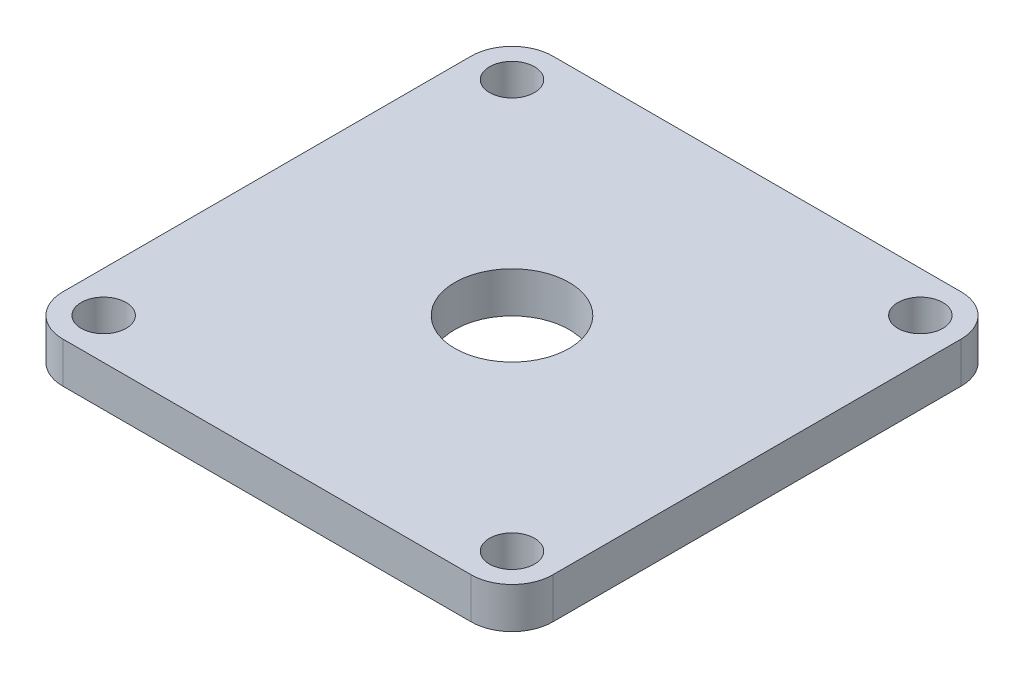
ISO-10303-21;
HEADER;
FILE_DESCRIPTION(('STEP AP214'),'2;1');
FILE_NAME('part.step','',(''),(''),'','','');
FILE_SCHEMA(('AUTOMOTIVE_DESIGN { 1 0 10303 214 1 1 1 1 }'));
ENDSEC;
DATA;
#1=APPLICATION_CONTEXT('core data for automotive mechanical design processes');
#2=APPLICATION_PROTOCOL_DEFINITION('international standard','automotive_design',2000,#1);
#3=PRODUCT_CONTEXT('',#1,'mechanical');
#4=PRODUCT('Part','Part','',(#3));
#5=PRODUCT_RELATED_PRODUCT_CATEGORY('part','',(#4));
#6=PRODUCT_DEFINITION_FORMATION('','',#4);
#7=PRODUCT_DEFINITION_CONTEXT('part definition',#1,'design');
#8=PRODUCT_DEFINITION('design','',#6,#7);
#9=PRODUCT_DEFINITION_SHAPE('','',#8);
#10=(LENGTH_UNIT() NAMED_UNIT(*) SI_UNIT(.MILLI.,.METRE.));
#11=(NAMED_UNIT(*) PLANE_ANGLE_UNIT() SI_UNIT($,.RADIAN.));
#12=(NAMED_UNIT(*) SI_UNIT($,.STERADIAN.) SOLID_ANGLE_UNIT());
#13=UNCERTAINTY_MEASURE_WITH_UNIT(LENGTH_MEASURE(1.E-05),#10,'distance_accuracy_value','');
#14=(GEOMETRIC_REPRESENTATION_CONTEXT(3) GLOBAL_UNCERTAINTY_ASSIGNED_CONTEXT((#13)) GLOBAL_UNIT_ASSIGNED_CONTEXT((#10,
#11,#12)) REPRESENTATION_CONTEXT('',''));
#15=CARTESIAN_POINT('',(0.,0.,0.));
#16=DIRECTION('',(0.,0.,1.));
#17=DIRECTION('',(1.,0.,0.));
#18=AXIS2_PLACEMENT_3D('',#15,#16,#17);
#19=CARTESIAN_POINT('',(-30.,5.,-30.));
#20=DIRECTION('',(1.,0.,0.));
#21=DIRECTION('',(0.,0.,-1.));
#22=AXIS2_PLACEMENT_3D('',#19,#20,#21);
#23=PLANE('',#22);
#24=DIRECTION('',(0.,0.,1.));
#25=VECTOR('',#24,1.);
#26=CARTESIAN_POINT('',(-30.,5.,-30.));
#27=LINE('',#26,#25);
#28=CARTESIAN_POINT('',(-30.,5.,-25.));
#29=VERTEX_POINT('',#28);
#30=CARTESIAN_POINT('',(-30.,5.,25.));
#31=VERTEX_POINT('',#30);
#32=EDGE_CURVE('E118',#29,#31,#27,.T.);
#33=ORIENTED_EDGE('',*,*,#32,.F.);
#34=DIRECTION('',(0.,-1.,0.));
#35=VECTOR('',#34,1.);
#36=CARTESIAN_POINT('',(-30.,5.,-25.));
#37=LINE('',#36,#35);
#38=CARTESIAN_POINT('',(-30.,0.,-25.));
#39=VERTEX_POINT('',#38);
#40=EDGE_CURVE('E103',#29,#39,#37,.T.);
#41=ORIENTED_EDGE('',*,*,#40,.T.);
#42=DIRECTION('',(0.,0.,1.));
#43=VECTOR('',#42,1.);
#44=CARTESIAN_POINT('',(-30.,0.,-30.));
#45=LINE('',#44,#43);
#46=CARTESIAN_POINT('',(-30.,0.,25.));
#47=VERTEX_POINT('',#46);
#48=EDGE_CURVE('E115',#39,#47,#45,.T.);
#49=ORIENTED_EDGE('',*,*,#48,.T.);
#50=DIRECTION('',(0.,-1.,0.));
#51=VECTOR('',#50,1.);
#52=CARTESIAN_POINT('',(-30.,5.,25.));
#53=LINE('',#52,#51);
#54=EDGE_CURVE('E120',#47,#31,#53,.F.);
#55=ORIENTED_EDGE('',*,*,#54,.T.);
#56=EDGE_LOOP('',(#33,#41,#49,#55));
#57=FACE_BOUND('',#56,.T.);
#58=ADVANCED_FACE('F33',(#57),#23,.F.);
#59=CARTESIAN_POINT('',(30.,5.,30.));
#60=DIRECTION('',(0.,0.,-1.));
#61=DIRECTION('',(-1.,0.,0.));
#62=AXIS2_PLACEMENT_3D('',#59,#60,#61);
#63=PLANE('',#62);
#64=DIRECTION('',(1.,0.,0.));
#65=VECTOR('',#64,1.);
#66=CARTESIAN_POINT('',(30.,5.,30.));
#67=LINE('',#66,#65);
#68=CARTESIAN_POINT('',(-25.,5.,30.));
#69=VERTEX_POINT('',#68);
#70=CARTESIAN_POINT('',(25.,5.,30.));
#71=VERTEX_POINT('',#70);
#72=EDGE_CURVE('E164',#69,#71,#67,.T.);
#73=ORIENTED_EDGE('',*,*,#72,.F.);
#74=DIRECTION('',(0.,-1.,0.));
#75=VECTOR('',#74,1.);
#76=CARTESIAN_POINT('',(-25.,5.,30.));
#77=LINE('',#76,#75);
#78=CARTESIAN_POINT('',(-25.,0.,30.));
#79=VERTEX_POINT('',#78);
#80=EDGE_CURVE('E157',#69,#79,#77,.T.);
#81=ORIENTED_EDGE('',*,*,#80,.T.);
#82=DIRECTION('',(1.,0.,0.));
#83=VECTOR('',#82,1.);
#84=CARTESIAN_POINT('',(30.,0.,30.));
#85=LINE('',#84,#83);
#86=CARTESIAN_POINT('',(25.,0.,30.));
#87=VERTEX_POINT('',#86);
#88=EDGE_CURVE('E124',#79,#87,#85,.T.);
#89=ORIENTED_EDGE('',*,*,#88,.T.);
#90=DIRECTION('',(0.,-1.,0.));
#91=VECTOR('',#90,1.);
#92=CARTESIAN_POINT('',(25.,5.,30.));
#93=LINE('',#92,#91);
#94=EDGE_CURVE('E155',#87,#71,#93,.F.);
#95=ORIENTED_EDGE('',*,*,#94,.T.);
#96=EDGE_LOOP('',(#73,#81,#89,#95));
#97=FACE_BOUND('',#96,.T.);
#98=ADVANCED_FACE('F162',(#97),#63,.F.);
#99=CARTESIAN_POINT('',(30.,5.,-30.));
#100=DIRECTION('',(-1.,0.,0.));
#101=DIRECTION('',(0.,0.,1.));
#102=AXIS2_PLACEMENT_3D('',#99,#100,#101);
#103=PLANE('',#102);
#104=DIRECTION('',(0.,0.,-1.));
#105=VECTOR('',#104,1.);
#106=CARTESIAN_POINT('',(30.,5.,-30.));
#107=LINE('',#106,#105);
#108=CARTESIAN_POINT('',(30.,5.,25.));
#109=VERTEX_POINT('',#108);
#110=CARTESIAN_POINT('',(30.,5.,-25.));
#111=VERTEX_POINT('',#110);
#112=EDGE_CURVE('E172',#109,#111,#107,.T.);
#113=ORIENTED_EDGE('',*,*,#112,.F.);
#114=DIRECTION('',(0.,-1.,0.));
#115=VECTOR('',#114,1.);
#116=CARTESIAN_POINT('',(30.,5.,25.));
#117=LINE('',#116,#115);
#118=CARTESIAN_POINT('',(30.,0.,25.));
#119=VERTEX_POINT('',#118);
#120=EDGE_CURVE('E11',#109,#119,#117,.T.);
#121=ORIENTED_EDGE('',*,*,#120,.T.);
#122=DIRECTION('',(0.,0.,-1.));
#123=VECTOR('',#122,1.);
#124=CARTESIAN_POINT('',(30.,0.,-30.));
#125=LINE('',#124,#123);
#126=CARTESIAN_POINT('',(30.,0.,-25.));
#127=VERTEX_POINT('',#126);
#128=EDGE_CURVE('E128',#119,#127,#125,.T.);
#129=ORIENTED_EDGE('',*,*,#128,.T.);
#130=DIRECTION('',(0.,-1.,0.));
#131=VECTOR('',#130,1.);
#132=CARTESIAN_POINT('',(30.,5.,-25.));
#133=LINE('',#132,#131);
#134=EDGE_CURVE('E41',#127,#111,#133,.F.);
#135=ORIENTED_EDGE('',*,*,#134,.T.);
#136=EDGE_LOOP('',(#113,#121,#129,#135));
#137=FACE_BOUND('',#136,.T.);
#138=ADVANCED_FACE('F171',(#137),#103,.F.);
#139=CARTESIAN_POINT('',(30.,5.,-30.));
#140=DIRECTION('',(0.,0.,1.));
#141=DIRECTION('',(1.,0.,0.));
#142=AXIS2_PLACEMENT_3D('',#139,#140,#141);
#143=PLANE('',#142);
#144=DIRECTION('',(-1.,0.,0.));
#145=VECTOR('',#144,1.);
#146=CARTESIAN_POINT('',(30.,0.,-30.));
#147=LINE('',#146,#145);
#148=CARTESIAN_POINT('',(25.,0.,-30.));
#149=VERTEX_POINT('',#148);
#150=CARTESIAN_POINT('',(-25.,0.,-30.));
#151=VERTEX_POINT('',#150);
#152=EDGE_CURVE('E138',#149,#151,#147,.T.);
#153=ORIENTED_EDGE('',*,*,#152,.T.);
#154=DIRECTION('',(0.,-1.,0.));
#155=VECTOR('',#154,1.);
#156=CARTESIAN_POINT('',(-25.,5.,-30.));
#157=LINE('',#156,#155);
#158=CARTESIAN_POINT('',(-25.,5.,-30.));
#159=VERTEX_POINT('',#158);
#160=EDGE_CURVE('E104',#151,#159,#157,.F.);
#161=ORIENTED_EDGE('',*,*,#160,.T.);
#162=DIRECTION('',(-1.,0.,0.));
#163=VECTOR('',#162,1.);
#164=CARTESIAN_POINT('',(30.,5.,-30.));
#165=LINE('',#164,#163);
#166=CARTESIAN_POINT('',(25.,5.,-30.));
#167=VERTEX_POINT('',#166);
#168=EDGE_CURVE('E134',#167,#159,#165,.T.);
#169=ORIENTED_EDGE('',*,*,#168,.F.);
#170=DIRECTION('',(0.,-1.,0.));
#171=VECTOR('',#170,1.);
#172=CARTESIAN_POINT('',(25.,5.,-30.));
#173=LINE('',#172,#171);
#174=EDGE_CURVE('E109',#167,#149,#173,.T.);
#175=ORIENTED_EDGE('',*,*,#174,.T.);
#176=EDGE_LOOP('',(#153,#161,#169,#175));
#177=FACE_BOUND('',#176,.T.);
#178=ADVANCED_FACE('F216',(#177),#143,.F.);
#179=CARTESIAN_POINT('',(0.,5.,0.));
#180=DIRECTION('',(0.,-1.,0.));
#181=DIRECTION('',(0.,0.,-1.));
#182=AXIS2_PLACEMENT_3D('',#179,#180,#181);
#183=PLANE('',#182);
#184=CARTESIAN_POINT('',(0.,5.,0.));
#185=DIRECTION('',(0.,1.,0.));
#186=DIRECTION('',(0.,0.,1.));
#187=AXIS2_PLACEMENT_3D('',#184,#185,#186);
#188=CIRCLE('',#187,7.);
#189=CARTESIAN_POINT('',(0.,5.,7.));
#190=VERTEX_POINT('',#189);
#191=EDGE_CURVE('E199',#190,#190,#188,.T.);
#192=ORIENTED_EDGE('',*,*,#191,.F.);
#193=EDGE_LOOP('',(#192));
#194=FACE_BOUND('',#193,.T.);
#195=CARTESIAN_POINT('',(25.0000000000005,5.,25.));
#196=DIRECTION('',(0.,1.,0.));
#197=DIRECTION('',(0.,0.,1.));
#198=AXIS2_PLACEMENT_3D('',#195,#196,#197);
#199=CIRCLE('',#198,2.75);
#200=CARTESIAN_POINT('',(25.0000000000005,5.,27.75));
#201=VERTEX_POINT('',#200);
#202=EDGE_CURVE('E181',#201,#201,#199,.T.);
#203=ORIENTED_EDGE('',*,*,#202,.F.);
#204=EDGE_LOOP('',(#203));
#205=FACE_BOUND('',#204,.T.);
#206=CARTESIAN_POINT('',(-24.9999999999995,5.,25.0000000000003));
#207=DIRECTION('',(0.,1.,0.));
#208=DIRECTION('',(0.,0.,1.));
#209=AXIS2_PLACEMENT_3D('',#206,#207,#208);
#210=CIRCLE('',#209,2.75);
#211=CARTESIAN_POINT('',(-24.9999999999995,5.,27.7500000000003));
#212=VERTEX_POINT('',#211);
#213=EDGE_CURVE('E188',#212,#212,#210,.T.);
#214=ORIENTED_EDGE('',*,*,#213,.F.);
#215=EDGE_LOOP('',(#214));
#216=FACE_BOUND('',#215,.T.);
#217=CARTESIAN_POINT('',(-25.,5.,-24.9999999999997));
#218=DIRECTION('',(0.,1.,0.));
#219=DIRECTION('',(0.,0.,1.));
#220=AXIS2_PLACEMENT_3D('',#217,#218,#219);
#221=CIRCLE('',#220,2.75);
#222=CARTESIAN_POINT('',(-25.,5.,-22.2499999999997));
#223=VERTEX_POINT('',#222);
#224=EDGE_CURVE('E194',#223,#223,#221,.T.);
#225=ORIENTED_EDGE('',*,*,#224,.F.);
#226=EDGE_LOOP('',(#225));
#227=FACE_BOUND('',#226,.T.);
#228=CARTESIAN_POINT('',(25.,5.,-25.));
#229=DIRECTION('',(0.,1.,0.));
#230=DIRECTION('',(0.,0.,1.));
#231=AXIS2_PLACEMENT_3D('',#228,#229,#230);
#232=CIRCLE('',#231,2.75);
#233=CARTESIAN_POINT('',(25.,5.,-22.25));
#234=VERTEX_POINT('',#233);
#235=EDGE_CURVE('E131',#234,#234,#232,.T.);
#236=ORIENTED_EDGE('',*,*,#235,.F.);
#237=EDGE_LOOP('',(#236));
#238=FACE_BOUND('',#237,.T.);
#239=ORIENTED_EDGE('',*,*,#168,.T.);
#240=CARTESIAN_POINT('',(-25.,5.,-25.));
#241=DIRECTION('',(0.,-1.,0.));
#242=DIRECTION('',(0.,0.,-1.));
#243=AXIS2_PLACEMENT_3D('',#240,#241,#242);
#244=CIRCLE('',#243,5.);
#245=EDGE_CURVE('E153',#159,#29,#244,.F.);
#246=ORIENTED_EDGE('',*,*,#245,.T.);
#247=ORIENTED_EDGE('',*,*,#32,.T.);
#248=CARTESIAN_POINT('',(-25.,5.,25.));
#249=DIRECTION('',(0.,-1.,0.));
#250=DIRECTION('',(0.,0.,-1.));
#251=AXIS2_PLACEMENT_3D('',#248,#249,#250);
#252=CIRCLE('',#251,5.);
#253=EDGE_CURVE('E151',#31,#69,#252,.F.);
#254=ORIENTED_EDGE('',*,*,#253,.T.);
#255=ORIENTED_EDGE('',*,*,#72,.T.);
#256=CARTESIAN_POINT('',(25.,5.,25.));
#257=DIRECTION('',(0.,-1.,0.));
#258=DIRECTION('',(0.,0.,-1.));
#259=AXIS2_PLACEMENT_3D('',#256,#257,#258);
#260=CIRCLE('',#259,5.);
#261=EDGE_CURVE('E54',#71,#109,#260,.F.);
#262=ORIENTED_EDGE('',*,*,#261,.T.);
#263=ORIENTED_EDGE('',*,*,#112,.T.);
#264=CARTESIAN_POINT('',(25.,5.,-25.));
#265=DIRECTION('',(0.,-1.,0.));
#266=DIRECTION('',(0.,0.,-1.));
#267=AXIS2_PLACEMENT_3D('',#264,#265,#266);
#268=CIRCLE('',#267,5.);
#269=EDGE_CURVE('E148',#111,#167,#268,.F.);
#270=ORIENTED_EDGE('',*,*,#269,.T.);
#271=EDGE_LOOP('',(#239,#246,#247,#254,#255,#262,#263,#270));
#272=FACE_BOUND('',#271,.T.);
#273=ADVANCED_FACE('F213',(#194,#205,#216,#227,#238,#272),#183,.F.);
#274=CARTESIAN_POINT('',(0.,0.,0.));
#275=DIRECTION('',(0.,-1.,0.));
#276=DIRECTION('',(0.,0.,-1.));
#277=AXIS2_PLACEMENT_3D('',#274,#275,#276);
#278=PLANE('',#277);
#279=CARTESIAN_POINT('',(0.,0.,0.));
#280=DIRECTION('',(0.,1.,0.));
#281=DIRECTION('',(0.,0.,1.));
#282=AXIS2_PLACEMENT_3D('',#279,#280,#281);
#283=CIRCLE('',#282,7.);
#284=CARTESIAN_POINT('',(0.,0.,7.));
#285=VERTEX_POINT('',#284);
#286=EDGE_CURVE('E185',#285,#285,#283,.T.);
#287=ORIENTED_EDGE('',*,*,#286,.T.);
#288=EDGE_LOOP('',(#287));
#289=FACE_BOUND('',#288,.T.);
#290=CARTESIAN_POINT('',(25.0000000000005,0.,25.));
#291=DIRECTION('',(0.,1.,0.));
#292=DIRECTION('',(0.,0.,1.));
#293=AXIS2_PLACEMENT_3D('',#290,#291,#292);
#294=CIRCLE('',#293,2.75);
#295=CARTESIAN_POINT('',(25.0000000000005,0.,27.75));
#296=VERTEX_POINT('',#295);
#297=EDGE_CURVE('E184',#296,#296,#294,.T.);
#298=ORIENTED_EDGE('',*,*,#297,.T.);
#299=EDGE_LOOP('',(#298));
#300=FACE_BOUND('',#299,.T.);
#301=CARTESIAN_POINT('',(-24.9999999999995,0.,25.0000000000003));
#302=DIRECTION('',(0.,1.,0.));
#303=DIRECTION('',(0.,0.,1.));
#304=AXIS2_PLACEMENT_3D('',#301,#302,#303);
#305=CIRCLE('',#304,2.75);
#306=CARTESIAN_POINT('',(-24.9999999999995,0.,27.7500000000003));
#307=VERTEX_POINT('',#306);
#308=EDGE_CURVE('E191',#307,#307,#305,.T.);
#309=ORIENTED_EDGE('',*,*,#308,.T.);
#310=EDGE_LOOP('',(#309));
#311=FACE_BOUND('',#310,.T.);
#312=CARTESIAN_POINT('',(-25.,0.,-24.9999999999997));
#313=DIRECTION('',(0.,1.,0.));
#314=DIRECTION('',(0.,0.,1.));
#315=AXIS2_PLACEMENT_3D('',#312,#313,#314);
#316=CIRCLE('',#315,2.75);
#317=CARTESIAN_POINT('',(-25.,0.,-22.2499999999997));
#318=VERTEX_POINT('',#317);
#319=EDGE_CURVE('E179',#318,#318,#316,.T.);
#320=ORIENTED_EDGE('',*,*,#319,.T.);
#321=EDGE_LOOP('',(#320));
#322=FACE_BOUND('',#321,.T.);
#323=CARTESIAN_POINT('',(25.,0.,-25.));
#324=DIRECTION('',(0.,1.,0.));
#325=DIRECTION('',(0.,0.,1.));
#326=AXIS2_PLACEMENT_3D('',#323,#324,#325);
#327=CIRCLE('',#326,2.75);
#328=CARTESIAN_POINT('',(25.,0.,-22.25));
#329=VERTEX_POINT('',#328);
#330=EDGE_CURVE('E125',#329,#329,#327,.T.);
#331=ORIENTED_EDGE('',*,*,#330,.T.);
#332=EDGE_LOOP('',(#331));
#333=FACE_BOUND('',#332,.T.);
#334=ORIENTED_EDGE('',*,*,#48,.F.);
#335=CARTESIAN_POINT('',(-25.,0.,-25.));
#336=DIRECTION('',(0.,-1.,0.));
#337=DIRECTION('',(0.,0.,-1.));
#338=AXIS2_PLACEMENT_3D('',#335,#336,#337);
#339=CIRCLE('',#338,5.);
#340=EDGE_CURVE('E99',#39,#151,#339,.T.);
#341=ORIENTED_EDGE('',*,*,#340,.T.);
#342=ORIENTED_EDGE('',*,*,#152,.F.);
#343=CARTESIAN_POINT('',(25.,0.,-25.));
#344=DIRECTION('',(0.,-1.,0.));
#345=DIRECTION('',(0.,0.,-1.));
#346=AXIS2_PLACEMENT_3D('',#343,#344,#345);
#347=CIRCLE('',#346,5.);
#348=EDGE_CURVE('E119',#149,#127,#347,.T.);
#349=ORIENTED_EDGE('',*,*,#348,.T.);
#350=ORIENTED_EDGE('',*,*,#128,.F.);
#351=CARTESIAN_POINT('',(25.,0.,25.));
#352=DIRECTION('',(0.,-1.,0.));
#353=DIRECTION('',(0.,0.,-1.));
#354=AXIS2_PLACEMENT_3D('',#351,#352,#353);
#355=CIRCLE('',#354,5.);
#356=EDGE_CURVE('E142',#119,#87,#355,.T.);
#357=ORIENTED_EDGE('',*,*,#356,.T.);
#358=ORIENTED_EDGE('',*,*,#88,.F.);
#359=CARTESIAN_POINT('',(-25.,0.,25.));
#360=DIRECTION('',(0.,-1.,0.));
#361=DIRECTION('',(0.,0.,-1.));
#362=AXIS2_PLACEMENT_3D('',#359,#360,#361);
#363=CIRCLE('',#362,5.);
#364=EDGE_CURVE('E110',#79,#47,#363,.T.);
#365=ORIENTED_EDGE('',*,*,#364,.T.);
#366=EDGE_LOOP('',(#334,#341,#342,#349,#350,#357,#358,#365));
#367=FACE_BOUND('',#366,.T.);
#368=ADVANCED_FACE('F122',(#289,#300,#311,#322,#333,#367),#278,.T.);
#369=CARTESIAN_POINT('',(25.,0.,-25.));
#370=DIRECTION('',(0.,1.,0.));
#371=DIRECTION('',(0.,0.,1.));
#372=AXIS2_PLACEMENT_3D('',#369,#370,#371);
#373=CYLINDRICAL_SURFACE('',#372,2.75);
#374=ORIENTED_EDGE('',*,*,#330,.F.);
#375=EDGE_LOOP('',(#374));
#376=FACE_BOUND('',#375,.T.);
#377=ORIENTED_EDGE('',*,*,#235,.T.);
#378=EDGE_LOOP('',(#377));
#379=FACE_BOUND('',#378,.T.);
#380=ADVANCED_FACE('F277',(#376,#379),#373,.F.);
#381=CARTESIAN_POINT('',(-25.,0.,-24.9999999999997));
#382=DIRECTION('',(0.,1.,0.));
#383=DIRECTION('',(0.,0.,1.));
#384=AXIS2_PLACEMENT_3D('',#381,#382,#383);
#385=CYLINDRICAL_SURFACE('',#384,2.75);
#386=ORIENTED_EDGE('',*,*,#319,.F.);
#387=EDGE_LOOP('',(#386));
#388=FACE_BOUND('',#387,.T.);
#389=ORIENTED_EDGE('',*,*,#224,.T.);
#390=EDGE_LOOP('',(#389));
#391=FACE_BOUND('',#390,.T.);
#392=ADVANCED_FACE('F291',(#388,#391),#385,.F.);
#393=CARTESIAN_POINT('',(-24.9999999999995,0.,25.0000000000003));
#394=DIRECTION('',(0.,1.,0.));
#395=DIRECTION('',(0.,0.,1.));
#396=AXIS2_PLACEMENT_3D('',#393,#394,#395);
#397=CYLINDRICAL_SURFACE('',#396,2.75);
#398=ORIENTED_EDGE('',*,*,#308,.F.);
#399=EDGE_LOOP('',(#398));
#400=FACE_BOUND('',#399,.T.);
#401=ORIENTED_EDGE('',*,*,#213,.T.);
#402=EDGE_LOOP('',(#401));
#403=FACE_BOUND('',#402,.T.);
#404=ADVANCED_FACE('F298',(#400,#403),#397,.F.);
#405=CARTESIAN_POINT('',(25.0000000000005,0.,25.));
#406=DIRECTION('',(0.,1.,0.));
#407=DIRECTION('',(0.,0.,1.));
#408=AXIS2_PLACEMENT_3D('',#405,#406,#407);
#409=CYLINDRICAL_SURFACE('',#408,2.75);
#410=ORIENTED_EDGE('',*,*,#297,.F.);
#411=EDGE_LOOP('',(#410));
#412=FACE_BOUND('',#411,.T.);
#413=ORIENTED_EDGE('',*,*,#202,.T.);
#414=EDGE_LOOP('',(#413));
#415=FACE_BOUND('',#414,.T.);
#416=ADVANCED_FACE('F244',(#412,#415),#409,.F.);
#417=CARTESIAN_POINT('',(-25.,5.,-25.));
#418=DIRECTION('',(0.,-1.,0.));
#419=DIRECTION('',(0.,0.,-1.));
#420=AXIS2_PLACEMENT_3D('',#417,#418,#419);
#421=CYLINDRICAL_SURFACE('',#420,5.);
#422=ORIENTED_EDGE('',*,*,#245,.F.);
#423=ORIENTED_EDGE('',*,*,#160,.F.);
#424=ORIENTED_EDGE('',*,*,#340,.F.);
#425=ORIENTED_EDGE('',*,*,#40,.F.);
#426=EDGE_LOOP('',(#422,#423,#424,#425));
#427=FACE_BOUND('',#426,.T.);
#428=ADVANCED_FACE('F102',(#427),#421,.T.);
#429=CARTESIAN_POINT('',(-25.,5.,25.));
#430=DIRECTION('',(0.,-1.,0.));
#431=DIRECTION('',(0.,0.,-1.));
#432=AXIS2_PLACEMENT_3D('',#429,#430,#431);
#433=CYLINDRICAL_SURFACE('',#432,5.);
#434=ORIENTED_EDGE('',*,*,#253,.F.);
#435=ORIENTED_EDGE('',*,*,#54,.F.);
#436=ORIENTED_EDGE('',*,*,#364,.F.);
#437=ORIENTED_EDGE('',*,*,#80,.F.);
#438=EDGE_LOOP('',(#434,#435,#436,#437));
#439=FACE_BOUND('',#438,.T.);
#440=ADVANCED_FACE('F233',(#439),#433,.T.);
#441=CARTESIAN_POINT('',(25.,5.,25.));
#442=DIRECTION('',(0.,-1.,0.));
#443=DIRECTION('',(0.,0.,-1.));
#444=AXIS2_PLACEMENT_3D('',#441,#442,#443);
#445=CYLINDRICAL_SURFACE('',#444,5.);
#446=ORIENTED_EDGE('',*,*,#261,.F.);
#447=ORIENTED_EDGE('',*,*,#94,.F.);
#448=ORIENTED_EDGE('',*,*,#356,.F.);
#449=ORIENTED_EDGE('',*,*,#120,.F.);
#450=EDGE_LOOP('',(#446,#447,#448,#449));
#451=FACE_BOUND('',#450,.T.);
#452=ADVANCED_FACE('F170',(#451),#445,.T.);
#453=CARTESIAN_POINT('',(25.,5.,-25.));
#454=DIRECTION('',(0.,-1.,0.));
#455=DIRECTION('',(0.,0.,-1.));
#456=AXIS2_PLACEMENT_3D('',#453,#454,#455);
#457=CYLINDRICAL_SURFACE('',#456,5.);
#458=ORIENTED_EDGE('',*,*,#269,.F.);
#459=ORIENTED_EDGE('',*,*,#134,.F.);
#460=ORIENTED_EDGE('',*,*,#348,.F.);
#461=ORIENTED_EDGE('',*,*,#174,.F.);
#462=EDGE_LOOP('',(#458,#459,#460,#461));
#463=FACE_BOUND('',#462,.T.);
#464=ADVANCED_FACE('F35',(#463),#457,.T.);
#465=CARTESIAN_POINT('',(0.,0.,0.));
#466=DIRECTION('',(0.,1.,0.));
#467=DIRECTION('',(0.,0.,1.));
#468=AXIS2_PLACEMENT_3D('',#465,#466,#467);
#469=CYLINDRICAL_SURFACE('',#468,7.);
#470=ORIENTED_EDGE('',*,*,#286,.F.);
#471=EDGE_LOOP('',(#470));
#472=FACE_BOUND('',#471,.T.);
#473=ORIENTED_EDGE('',*,*,#191,.T.);
#474=EDGE_LOOP('',(#473));
#475=FACE_BOUND('',#474,.T.);
#476=ADVANCED_FACE('F207',(#472,#475),#469,.F.);
#477=CLOSED_SHELL('',(#58,#98,#138,#178,#273,#368,#380,#392,#404,#416,#428,#440,#452,#464,#476));
#478=MANIFOLD_SOLID_BREP('B2',#477);
#479=ADVANCED_BREP_SHAPE_REPRESENTATION('',(#18,#478),#14);
#480=SHAPE_DEFINITION_REPRESENTATION(#9,#479);
ENDSEC;
END-ISO-10303-21;
